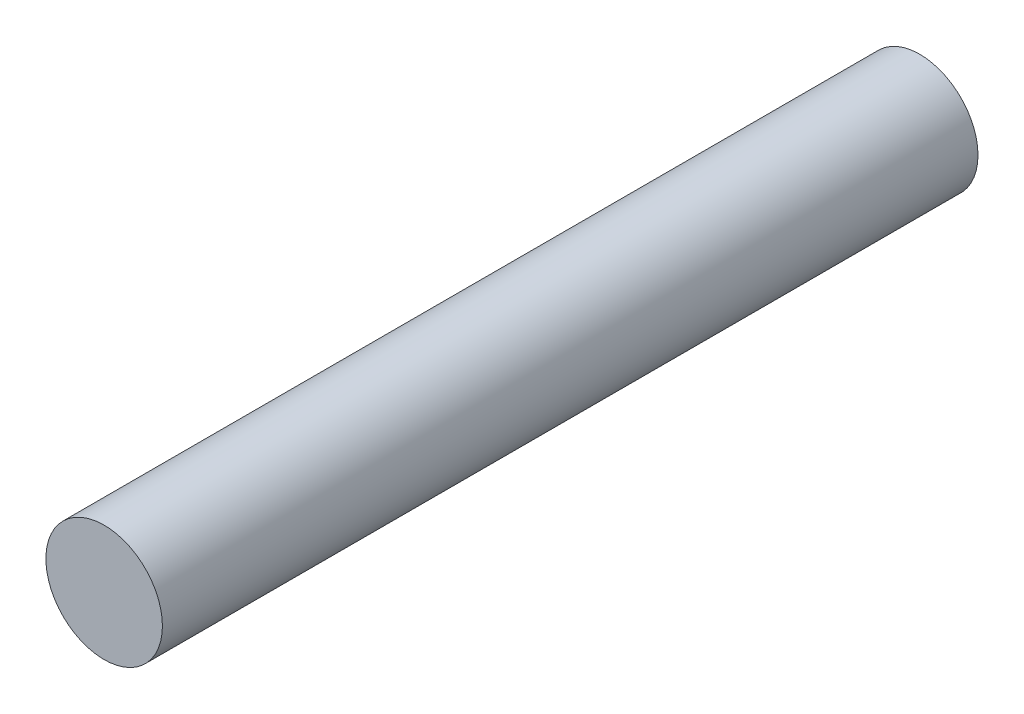
ISO-10303-21;
HEADER;
FILE_DESCRIPTION(('STEP AP214'),'2;1');
FILE_NAME('part.step','',(''),(''),'','','');
FILE_SCHEMA(('AUTOMOTIVE_DESIGN { 1 0 10303 214 1 1 1 1 }'));
ENDSEC;
DATA;
#1=APPLICATION_CONTEXT('core data for automotive mechanical design processes');
#2=APPLICATION_PROTOCOL_DEFINITION('international standard','automotive_design',2000,#1);
#3=PRODUCT_CONTEXT('',#1,'mechanical');
#4=PRODUCT('Part','Part','',(#3));
#5=PRODUCT_RELATED_PRODUCT_CATEGORY('part','',(#4));
#6=PRODUCT_DEFINITION_FORMATION('','',#4);
#7=PRODUCT_DEFINITION_CONTEXT('part definition',#1,'design');
#8=PRODUCT_DEFINITION('design','',#6,#7);
#9=PRODUCT_DEFINITION_SHAPE('','',#8);
#10=(LENGTH_UNIT() NAMED_UNIT(*) SI_UNIT(.MILLI.,.METRE.));
#11=(NAMED_UNIT(*) PLANE_ANGLE_UNIT() SI_UNIT($,.RADIAN.));
#12=(NAMED_UNIT(*) SI_UNIT($,.STERADIAN.) SOLID_ANGLE_UNIT());
#13=UNCERTAINTY_MEASURE_WITH_UNIT(LENGTH_MEASURE(1.E-05),#10,'distance_accuracy_value','');
#14=(GEOMETRIC_REPRESENTATION_CONTEXT(3) GLOBAL_UNCERTAINTY_ASSIGNED_CONTEXT((#13)) GLOBAL_UNIT_ASSIGNED_CONTEXT((#10,
#11,#12)) REPRESENTATION_CONTEXT('',''));
#15=CARTESIAN_POINT('',(0.,0.,0.));
#16=DIRECTION('',(0.,0.,1.));
#17=DIRECTION('',(1.,0.,0.));
#18=AXIS2_PLACEMENT_3D('',#15,#16,#17);
#19=CARTESIAN_POINT('',(0.,0.,14.));
#20=DIRECTION('',(0.,0.,-1.));
#21=DIRECTION('',(-1.,0.,0.));
#22=AXIS2_PLACEMENT_3D('',#19,#20,#21);
#23=CYLINDRICAL_SURFACE('',#22,2.);
#24=CARTESIAN_POINT('',(0.,0.,14.));
#25=DIRECTION('',(0.,0.,1.));
#26=DIRECTION('',(1.,0.,0.));
#27=AXIS2_PLACEMENT_3D('',#24,#25,#26);
#28=CIRCLE('',#27,2.);
#29=CARTESIAN_POINT('',(2.,0.,14.));
#30=VERTEX_POINT('',#29);
#31=EDGE_CURVE('E10',#30,#30,#28,.T.);
#32=ORIENTED_EDGE('',*,*,#31,.F.);
#33=EDGE_LOOP('',(#32));
#34=FACE_BOUND('',#33,.T.);
#35=CARTESIAN_POINT('',(0.,0.,-14.));
#36=DIRECTION('',(0.,0.,1.));
#37=DIRECTION('',(1.,0.,0.));
#38=AXIS2_PLACEMENT_3D('',#35,#36,#37);
#39=CIRCLE('',#38,2.);
#40=CARTESIAN_POINT('',(2.,0.,-14.));
#41=VERTEX_POINT('',#40);
#42=EDGE_CURVE('E34',#41,#41,#39,.T.);
#43=ORIENTED_EDGE('',*,*,#42,.T.);
#44=EDGE_LOOP('',(#43));
#45=FACE_BOUND('',#44,.T.);
#46=ADVANCED_FACE('F31',(#34,#45),#23,.T.);
#47=CARTESIAN_POINT('',(0.,0.,14.));
#48=DIRECTION('',(0.,0.,1.));
#49=DIRECTION('',(1.,0.,0.));
#50=AXIS2_PLACEMENT_3D('',#47,#48,#49);
#51=PLANE('',#50);
#52=ORIENTED_EDGE('',*,*,#31,.T.);
#53=EDGE_LOOP('',(#52));
#54=FACE_BOUND('',#53,.T.);
#55=ADVANCED_FACE('F46',(#54),#51,.T.);
#56=CARTESIAN_POINT('',(0.,0.,-14.));
#57=DIRECTION('',(0.,0.,1.));
#58=DIRECTION('',(1.,0.,0.));
#59=AXIS2_PLACEMENT_3D('',#56,#57,#58);
#60=PLANE('',#59);
#61=ORIENTED_EDGE('',*,*,#42,.F.);
#62=EDGE_LOOP('',(#61));
#63=FACE_BOUND('',#62,.T.);
#64=ADVANCED_FACE('F44',(#63),#60,.F.);
#65=CLOSED_SHELL('',(#46,#55,#64));
#66=MANIFOLD_SOLID_BREP('B2',#65);
#67=ADVANCED_BREP_SHAPE_REPRESENTATION('',(#18,#66),#14);
#68=SHAPE_DEFINITION_REPRESENTATION(#9,#67);
ENDSEC;
END-ISO-10303-21;
